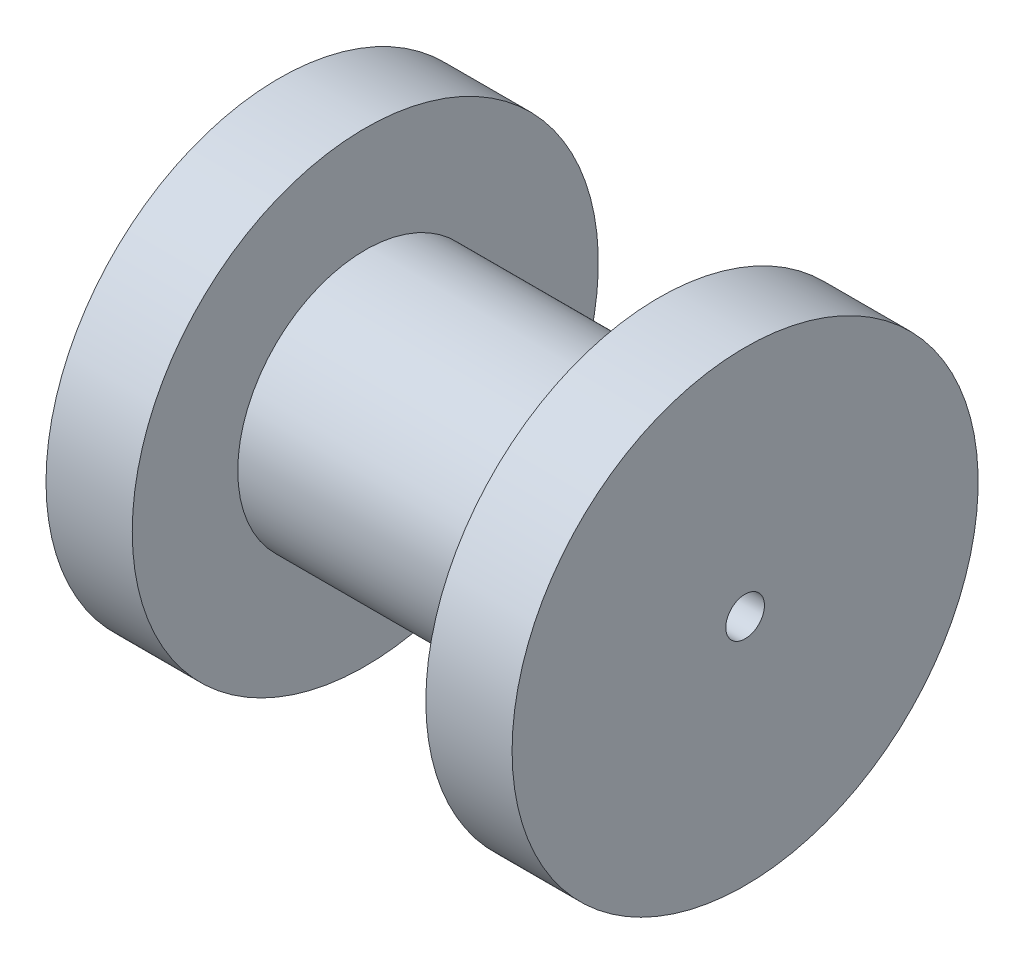
ISO-10303-21;
HEADER;
FILE_DESCRIPTION(('STEP AP214'),'2;1');
FILE_NAME('part.step','',(''),(''),'','','');
FILE_SCHEMA(('AUTOMOTIVE_DESIGN { 1 0 10303 214 1 1 1 1 }'));
ENDSEC;
DATA;
#1=APPLICATION_CONTEXT('core data for automotive mechanical design processes');
#2=APPLICATION_PROTOCOL_DEFINITION('international standard','automotive_design',2000,#1);
#3=PRODUCT_CONTEXT('',#1,'mechanical');
#4=PRODUCT('Part','Part','',(#3));
#5=PRODUCT_RELATED_PRODUCT_CATEGORY('part','',(#4));
#6=PRODUCT_DEFINITION_FORMATION('','',#4);
#7=PRODUCT_DEFINITION_CONTEXT('part definition',#1,'design');
#8=PRODUCT_DEFINITION('design','',#6,#7);
#9=PRODUCT_DEFINITION_SHAPE('','',#8);
#10=(LENGTH_UNIT() NAMED_UNIT(*) SI_UNIT(.MILLI.,.METRE.));
#11=(NAMED_UNIT(*) PLANE_ANGLE_UNIT() SI_UNIT($,.RADIAN.));
#12=(NAMED_UNIT(*) SI_UNIT($,.STERADIAN.) SOLID_ANGLE_UNIT());
#13=UNCERTAINTY_MEASURE_WITH_UNIT(LENGTH_MEASURE(1.E-05),#10,'distance_accuracy_value','');
#14=(GEOMETRIC_REPRESENTATION_CONTEXT(3) GLOBAL_UNCERTAINTY_ASSIGNED_CONTEXT((#13)) GLOBAL_UNIT_ASSIGNED_CONTEXT((#10,
#11,#12)) REPRESENTATION_CONTEXT('',''));
#15=CARTESIAN_POINT('',(0.,0.,0.));
#16=DIRECTION('',(0.,0.,1.));
#17=DIRECTION('',(1.,0.,0.));
#18=AXIS2_PLACEMENT_3D('',#15,#16,#17);
#19=CARTESIAN_POINT('',(-8.,0.,12.7));
#20=DIRECTION('',(1.,0.,0.));
#21=DIRECTION('',(0.,0.,-1.));
#22=AXIS2_PLACEMENT_3D('',#19,#20,#21);
#23=PLANE('',#22);
#24=CARTESIAN_POINT('',(-8.,0.,0.));
#25=DIRECTION('',(-1.,0.,0.));
#26=DIRECTION('',(0.,0.,1.));
#27=AXIS2_PLACEMENT_3D('',#24,#25,#26);
#28=CIRCLE('',#27,6.94999999996138);
#29=CARTESIAN_POINT('',(-8.,0.,6.94999999996138));
#30=VERTEX_POINT('',#29);
#31=EDGE_CURVE('E67',#30,#30,#28,.T.);
#32=ORIENTED_EDGE('',*,*,#31,.T.);
#33=EDGE_LOOP('',(#32));
#34=FACE_BOUND('',#33,.T.);
#35=CARTESIAN_POINT('',(-8.,0.,0.));
#36=DIRECTION('',(-1.,0.,0.));
#37=DIRECTION('',(0.,0.,1.));
#38=AXIS2_PLACEMENT_3D('',#35,#36,#37);
#39=CIRCLE('',#38,12.7);
#40=CARTESIAN_POINT('',(-8.,0.,12.7));
#41=VERTEX_POINT('',#40);
#42=EDGE_CURVE('E12',#41,#41,#39,.T.);
#43=ORIENTED_EDGE('',*,*,#42,.F.);
#44=EDGE_LOOP('',(#43));
#45=FACE_BOUND('',#44,.T.);
#46=ADVANCED_FACE('F39',(#34,#45),#23,.T.);
#47=CARTESIAN_POINT('',(0.,0.,0.));
#48=DIRECTION('',(-1.,0.,0.));
#49=DIRECTION('',(0.,0.,1.));
#50=AXIS2_PLACEMENT_3D('',#47,#48,#49);
#51=CYLINDRICAL_SURFACE('',#50,12.7);
#52=ORIENTED_EDGE('',*,*,#42,.T.);
#53=EDGE_LOOP('',(#52));
#54=FACE_BOUND('',#53,.T.);
#55=CARTESIAN_POINT('',(-12.7,0.,0.));
#56=DIRECTION('',(-1.,0.,0.));
#57=DIRECTION('',(0.,0.,1.));
#58=AXIS2_PLACEMENT_3D('',#55,#56,#57);
#59=CIRCLE('',#58,12.7);
#60=CARTESIAN_POINT('',(-12.7,0.,12.7));
#61=VERTEX_POINT('',#60);
#62=EDGE_CURVE('E45',#61,#61,#59,.T.);
#63=ORIENTED_EDGE('',*,*,#62,.F.);
#64=EDGE_LOOP('',(#63));
#65=FACE_BOUND('',#64,.T.);
#66=ADVANCED_FACE('F85',(#54,#65),#51,.T.);
#67=CARTESIAN_POINT('',(-12.7,0.,12.7));
#68=DIRECTION('',(-1.,0.,0.));
#69=DIRECTION('',(0.,0.,1.));
#70=AXIS2_PLACEMENT_3D('',#67,#68,#69);
#71=PLANE('',#70);
#72=ORIENTED_EDGE('',*,*,#62,.T.);
#73=EDGE_LOOP('',(#72));
#74=FACE_BOUND('',#73,.T.);
#75=CARTESIAN_POINT('',(-12.7,0.,0.));
#76=DIRECTION('',(-1.,0.,0.));
#77=DIRECTION('',(0.,0.,1.));
#78=AXIS2_PLACEMENT_3D('',#75,#76,#77);
#79=CIRCLE('',#78,1.0541);
#80=CARTESIAN_POINT('',(-12.7,0.,1.0541));
#81=VERTEX_POINT('',#80);
#82=EDGE_CURVE('E49',#81,#81,#79,.T.);
#83=ORIENTED_EDGE('',*,*,#82,.F.);
#84=EDGE_LOOP('',(#83));
#85=FACE_BOUND('',#84,.T.);
#86=ADVANCED_FACE('F89',(#74,#85),#71,.T.);
#87=CARTESIAN_POINT('',(0.,0.,0.));
#88=DIRECTION('',(-1.,0.,0.));
#89=DIRECTION('',(0.,0.,1.));
#90=AXIS2_PLACEMENT_3D('',#87,#88,#89);
#91=CYLINDRICAL_SURFACE('',#90,1.0541);
#92=ORIENTED_EDGE('',*,*,#82,.T.);
#93=EDGE_LOOP('',(#92));
#94=FACE_BOUND('',#93,.T.);
#95=CARTESIAN_POINT('',(12.7,0.,0.));
#96=DIRECTION('',(-1.,0.,0.));
#97=DIRECTION('',(0.,0.,1.));
#98=AXIS2_PLACEMENT_3D('',#95,#96,#97);
#99=CIRCLE('',#98,1.0541);
#100=CARTESIAN_POINT('',(12.7,0.,1.0541));
#101=VERTEX_POINT('',#100);
#102=EDGE_CURVE('E53',#101,#101,#99,.T.);
#103=ORIENTED_EDGE('',*,*,#102,.F.);
#104=EDGE_LOOP('',(#103));
#105=FACE_BOUND('',#104,.T.);
#106=ADVANCED_FACE('F93',(#94,#105),#91,.F.);
#107=CARTESIAN_POINT('',(12.7,0.,12.7));
#108=DIRECTION('',(1.,0.,0.));
#109=DIRECTION('',(0.,0.,-1.));
#110=AXIS2_PLACEMENT_3D('',#107,#108,#109);
#111=PLANE('',#110);
#112=ORIENTED_EDGE('',*,*,#102,.T.);
#113=EDGE_LOOP('',(#112));
#114=FACE_BOUND('',#113,.T.);
#115=CARTESIAN_POINT('',(12.7,0.,0.));
#116=DIRECTION('',(-1.,0.,0.));
#117=DIRECTION('',(0.,0.,1.));
#118=AXIS2_PLACEMENT_3D('',#115,#116,#117);
#119=CIRCLE('',#118,12.7);
#120=CARTESIAN_POINT('',(12.7,0.,12.7));
#121=VERTEX_POINT('',#120);
#122=EDGE_CURVE('E58',#121,#121,#119,.T.);
#123=ORIENTED_EDGE('',*,*,#122,.F.);
#124=EDGE_LOOP('',(#123));
#125=FACE_BOUND('',#124,.T.);
#126=ADVANCED_FACE('F99',(#114,#125),#111,.T.);
#127=CARTESIAN_POINT('',(0.,0.,0.));
#128=DIRECTION('',(-1.,0.,0.));
#129=DIRECTION('',(0.,0.,1.));
#130=AXIS2_PLACEMENT_3D('',#127,#128,#129);
#131=CYLINDRICAL_SURFACE('',#130,12.7);
#132=ORIENTED_EDGE('',*,*,#122,.T.);
#133=EDGE_LOOP('',(#132));
#134=FACE_BOUND('',#133,.T.);
#135=CARTESIAN_POINT('',(8.,0.,0.));
#136=DIRECTION('',(-1.,0.,0.));
#137=DIRECTION('',(0.,0.,1.));
#138=AXIS2_PLACEMENT_3D('',#135,#136,#137);
#139=CIRCLE('',#138,12.7);
#140=CARTESIAN_POINT('',(8.,0.,12.7));
#141=VERTEX_POINT('',#140);
#142=EDGE_CURVE('E61',#141,#141,#139,.T.);
#143=ORIENTED_EDGE('',*,*,#142,.F.);
#144=EDGE_LOOP('',(#143));
#145=FACE_BOUND('',#144,.T.);
#146=ADVANCED_FACE('F81',(#134,#145),#131,.T.);
#147=CARTESIAN_POINT('',(8.,0.,12.7));
#148=DIRECTION('',(-1.,0.,0.));
#149=DIRECTION('',(0.,0.,1.));
#150=AXIS2_PLACEMENT_3D('',#147,#148,#149);
#151=PLANE('',#150);
#152=ORIENTED_EDGE('',*,*,#142,.T.);
#153=EDGE_LOOP('',(#152));
#154=FACE_BOUND('',#153,.T.);
#155=CARTESIAN_POINT('',(8.,0.,0.));
#156=DIRECTION('',(-1.,0.,0.));
#157=DIRECTION('',(0.,0.,1.));
#158=AXIS2_PLACEMENT_3D('',#155,#156,#157);
#159=CIRCLE('',#158,6.94999999996138);
#160=CARTESIAN_POINT('',(8.,0.,6.94999999996138));
#161=VERTEX_POINT('',#160);
#162=EDGE_CURVE('E64',#161,#161,#159,.T.);
#163=ORIENTED_EDGE('',*,*,#162,.F.);
#164=EDGE_LOOP('',(#163));
#165=FACE_BOUND('',#164,.T.);
#166=ADVANCED_FACE('F75',(#154,#165),#151,.T.);
#167=CARTESIAN_POINT('',(0.,0.,0.));
#168=DIRECTION('',(-1.,0.,0.));
#169=DIRECTION('',(0.,0.,1.));
#170=AXIS2_PLACEMENT_3D('',#167,#168,#169);
#171=CYLINDRICAL_SURFACE('',#170,6.94999999996138);
#172=ORIENTED_EDGE('',*,*,#162,.T.);
#173=EDGE_LOOP('',(#172));
#174=FACE_BOUND('',#173,.T.);
#175=ORIENTED_EDGE('',*,*,#31,.F.);
#176=EDGE_LOOP('',(#175));
#177=FACE_BOUND('',#176,.T.);
#178=ADVANCED_FACE('F73',(#174,#177),#171,.T.);
#179=CLOSED_SHELL('',(#46,#66,#86,#106,#126,#146,#166,#178));
#180=MANIFOLD_SOLID_BREP('B2',#179);
#181=ADVANCED_BREP_SHAPE_REPRESENTATION('',(#18,#180),#14);
#182=SHAPE_DEFINITION_REPRESENTATION(#9,#181);
ENDSEC;
END-ISO-10303-21;
